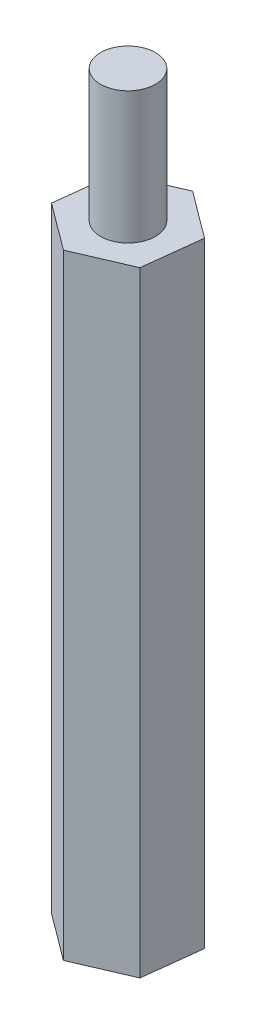
ISO-10303-21;
HEADER;
FILE_DESCRIPTION(('STEP AP214'),'2;1');
FILE_NAME('part.step','',(''),(''),'','','');
FILE_SCHEMA(('AUTOMOTIVE_DESIGN { 1 0 10303 214 1 1 1 1 }'));
ENDSEC;
DATA;
#1=APPLICATION_CONTEXT('core data for automotive mechanical design processes');
#2=APPLICATION_PROTOCOL_DEFINITION('international standard','automotive_design',2000,#1);
#3=PRODUCT_CONTEXT('',#1,'mechanical');
#4=PRODUCT('Part','Part','',(#3));
#5=PRODUCT_RELATED_PRODUCT_CATEGORY('part','',(#4));
#6=PRODUCT_DEFINITION_FORMATION('','',#4);
#7=PRODUCT_DEFINITION_CONTEXT('part definition',#1,'design');
#8=PRODUCT_DEFINITION('design','',#6,#7);
#9=PRODUCT_DEFINITION_SHAPE('','',#8);
#10=(LENGTH_UNIT() NAMED_UNIT(*) SI_UNIT(.MILLI.,.METRE.));
#11=(NAMED_UNIT(*) PLANE_ANGLE_UNIT() SI_UNIT($,.RADIAN.));
#12=(NAMED_UNIT(*) SI_UNIT($,.STERADIAN.) SOLID_ANGLE_UNIT());
#13=UNCERTAINTY_MEASURE_WITH_UNIT(LENGTH_MEASURE(1.E-05),#10,'distance_accuracy_value','');
#14=(GEOMETRIC_REPRESENTATION_CONTEXT(3) GLOBAL_UNCERTAINTY_ASSIGNED_CONTEXT((#13)) GLOBAL_UNIT_ASSIGNED_CONTEXT((#10,
#11,#12)) REPRESENTATION_CONTEXT('',''));
#15=CARTESIAN_POINT('',(0.,0.,0.));
#16=DIRECTION('',(0.,0.,1.));
#17=DIRECTION('',(1.,0.,0.));
#18=AXIS2_PLACEMENT_3D('',#15,#16,#17);
#19=CARTESIAN_POINT('',(-0.30848263547383,28.,2.63198375063584));
#20=DIRECTION('',(-0.395787953347626,0.,-0.918341927598265));
#21=DIRECTION('',(-0.918341927598265,0.,0.395787953347627));
#22=AXIS2_PLACEMENT_3D('',#19,#20,#21);
#23=PLANE('',#22);
#24=DIRECTION('',(0.918341927598265,0.,-0.395787953347626));
#25=VECTOR('',#24,1.);
#26=CARTESIAN_POINT('',(-0.30848263547383,0.,2.63198375063584));
#27=LINE('',#26,#25);
#28=CARTESIAN_POINT('',(-0.30848263547383,0.,2.63198375063584));
#29=VERTEX_POINT('',#28);
#30=CARTESIAN_POINT('',(2.12512347266157,0.,1.58314567426463));
#31=VERTEX_POINT('',#30);
#32=EDGE_CURVE('E124',#29,#31,#27,.T.);
#33=ORIENTED_EDGE('',*,*,#32,.T.);
#34=DIRECTION('',(0.,-1.,0.));
#35=VECTOR('',#34,1.);
#36=CARTESIAN_POINT('',(2.12512347266157,28.,1.58314567426463));
#37=LINE('',#36,#35);
#38=CARTESIAN_POINT('',(2.12512347266157,28.,1.58314567426463));
#39=VERTEX_POINT('',#38);
#40=EDGE_CURVE('E41',#39,#31,#37,.T.);
#41=ORIENTED_EDGE('',*,*,#40,.F.);
#42=DIRECTION('',(0.918341927598265,0.,-0.395787953347626));
#43=VECTOR('',#42,1.);
#44=CARTESIAN_POINT('',(-0.30848263547383,28.,2.63198375063584));
#45=LINE('',#44,#43);
#46=CARTESIAN_POINT('',(-0.30848263547383,28.,2.63198375063584));
#47=VERTEX_POINT('',#46);
#48=EDGE_CURVE('E135',#47,#39,#45,.T.);
#49=ORIENTED_EDGE('',*,*,#48,.F.);
#50=DIRECTION('',(0.,-1.,0.));
#51=VECTOR('',#50,1.);
#52=CARTESIAN_POINT('',(-0.30848263547383,28.,2.63198375063584));
#53=LINE('',#52,#51);
#54=EDGE_CURVE('E120',#47,#29,#53,.T.);
#55=ORIENTED_EDGE('',*,*,#54,.T.);
#56=EDGE_LOOP('',(#33,#41,#49,#55));
#57=FACE_BOUND('',#56,.T.);
#58=ADVANCED_FACE('F38',(#57),#23,.F.);
#59=CARTESIAN_POINT('',(2.12512347266157,28.,1.58314567426463));
#60=DIRECTION('',(-0.993201415334281,0.,-0.116408541688238));
#61=DIRECTION('',(-0.116408541688238,0.,0.993201415334281));
#62=AXIS2_PLACEMENT_3D('',#59,#60,#61);
#63=PLANE('',#62);
#64=DIRECTION('',(0.116408541688238,0.,-0.99320141533428));
#65=VECTOR('',#64,1.);
#66=CARTESIAN_POINT('',(2.12512347266157,0.,1.58314567426463));
#67=LINE('',#66,#65);
#68=CARTESIAN_POINT('',(2.4336061081354,0.,-1.04883807637121));
#69=VERTEX_POINT('',#68);
#70=EDGE_CURVE('E127',#31,#69,#67,.T.);
#71=ORIENTED_EDGE('',*,*,#70,.T.);
#72=DIRECTION('',(0.,-1.,0.));
#73=VECTOR('',#72,1.);
#74=CARTESIAN_POINT('',(2.4336061081354,28.,-1.04883807637121));
#75=LINE('',#74,#73);
#76=CARTESIAN_POINT('',(2.4336061081354,28.,-1.04883807637121));
#77=VERTEX_POINT('',#76);
#78=EDGE_CURVE('E138',#77,#69,#75,.T.);
#79=ORIENTED_EDGE('',*,*,#78,.F.);
#80=DIRECTION('',(0.116408541688238,0.,-0.99320141533428));
#81=VECTOR('',#80,1.);
#82=CARTESIAN_POINT('',(2.12512347266157,28.,1.58314567426463));
#83=LINE('',#82,#81);
#84=EDGE_CURVE('E93',#39,#77,#83,.T.);
#85=ORIENTED_EDGE('',*,*,#84,.F.);
#86=ORIENTED_EDGE('',*,*,#40,.T.);
#87=EDGE_LOOP('',(#71,#79,#85,#86));
#88=FACE_BOUND('',#87,.T.);
#89=ADVANCED_FACE('F143',(#88),#63,.F.);
#90=CARTESIAN_POINT('',(2.4336061081354,28.,-1.04883807637121));
#91=DIRECTION('',(-0.597413461986654,0.,0.801933385910027));
#92=DIRECTION('',(0.801933385910027,0.,0.597413461986654));
#93=AXIS2_PLACEMENT_3D('',#90,#91,#92);
#94=PLANE('',#93);
#95=DIRECTION('',(-0.801933385910027,0.,-0.597413461986654));
#96=VECTOR('',#95,1.);
#97=CARTESIAN_POINT('',(2.4336061081354,0.,-1.04883807637121));
#98=LINE('',#97,#96);
#99=CARTESIAN_POINT('',(0.308482635473831,0.,-2.63198375063584));
#100=VERTEX_POINT('',#99);
#101=EDGE_CURVE('E130',#69,#100,#98,.T.);
#102=ORIENTED_EDGE('',*,*,#101,.T.);
#103=DIRECTION('',(0.,-1.,0.));
#104=VECTOR('',#103,1.);
#105=CARTESIAN_POINT('',(0.308482635473831,28.,-2.63198375063584));
#106=LINE('',#105,#104);
#107=CARTESIAN_POINT('',(0.308482635473831,28.,-2.63198375063584));
#108=VERTEX_POINT('',#107);
#109=EDGE_CURVE('E115',#108,#100,#106,.T.);
#110=ORIENTED_EDGE('',*,*,#109,.F.);
#111=DIRECTION('',(-0.801933385910027,0.,-0.597413461986654));
#112=VECTOR('',#111,1.);
#113=CARTESIAN_POINT('',(2.4336061081354,28.,-1.04883807637121));
#114=LINE('',#113,#112);
#115=EDGE_CURVE('E106',#77,#108,#114,.T.);
#116=ORIENTED_EDGE('',*,*,#115,.F.);
#117=ORIENTED_EDGE('',*,*,#78,.T.);
#118=EDGE_LOOP('',(#102,#110,#116,#117));
#119=FACE_BOUND('',#118,.T.);
#120=ADVANCED_FACE('F149',(#119),#94,.F.);
#121=CARTESIAN_POINT('',(0.308482635473831,28.,-2.63198375063584));
#122=DIRECTION('',(0.395787953347626,0.,0.918341927598265));
#123=DIRECTION('',(0.918341927598265,0.,-0.395787953347626));
#124=AXIS2_PLACEMENT_3D('',#121,#122,#123);
#125=PLANE('',#124);
#126=DIRECTION('',(-0.918341927598265,0.,0.395787953347626));
#127=VECTOR('',#126,1.);
#128=CARTESIAN_POINT('',(0.308482635473831,0.,-2.63198375063584));
#129=LINE('',#128,#127);
#130=CARTESIAN_POINT('',(-2.12512347266157,0.,-1.58314567426463));
#131=VERTEX_POINT('',#130);
#132=EDGE_CURVE('E114',#100,#131,#129,.T.);
#133=ORIENTED_EDGE('',*,*,#132,.T.);
#134=DIRECTION('',(0.,-1.,0.));
#135=VECTOR('',#134,1.);
#136=CARTESIAN_POINT('',(-2.12512347266157,28.,-1.58314567426463));
#137=LINE('',#136,#135);
#138=CARTESIAN_POINT('',(-2.12512347266157,28.,-1.58314567426463));
#139=VERTEX_POINT('',#138);
#140=EDGE_CURVE('E111',#139,#131,#137,.T.);
#141=ORIENTED_EDGE('',*,*,#140,.F.);
#142=DIRECTION('',(-0.918341927598265,0.,0.395787953347626));
#143=VECTOR('',#142,1.);
#144=CARTESIAN_POINT('',(0.308482635473831,28.,-2.63198375063584));
#145=LINE('',#144,#143);
#146=EDGE_CURVE('E100',#108,#139,#145,.T.);
#147=ORIENTED_EDGE('',*,*,#146,.F.);
#148=ORIENTED_EDGE('',*,*,#109,.T.);
#149=EDGE_LOOP('',(#133,#141,#147,#148));
#150=FACE_BOUND('',#149,.T.);
#151=ADVANCED_FACE('F112',(#150),#125,.F.);
#152=CARTESIAN_POINT('',(-2.12512347266157,28.,-1.58314567426463));
#153=DIRECTION('',(0.993201415334281,0.,0.116408541688238));
#154=DIRECTION('',(0.116408541688238,0.,-0.993201415334281));
#155=AXIS2_PLACEMENT_3D('',#152,#153,#154);
#156=PLANE('',#155);
#157=DIRECTION('',(-0.116408541688238,0.,0.99320141533428));
#158=VECTOR('',#157,1.);
#159=CARTESIAN_POINT('',(-2.12512347266157,0.,-1.58314567426463));
#160=LINE('',#159,#158);
#161=CARTESIAN_POINT('',(-2.4336061081354,0.,1.04883807637121));
#162=VERTEX_POINT('',#161);
#163=EDGE_CURVE('E78',#131,#162,#160,.T.);
#164=ORIENTED_EDGE('',*,*,#163,.T.);
#165=DIRECTION('',(0.,-1.,0.));
#166=VECTOR('',#165,1.);
#167=CARTESIAN_POINT('',(-2.4336061081354,28.,1.04883807637121));
#168=LINE('',#167,#166);
#169=CARTESIAN_POINT('',(-2.4336061081354,28.,1.04883807637121));
#170=VERTEX_POINT('',#169);
#171=EDGE_CURVE('E116',#170,#162,#168,.T.);
#172=ORIENTED_EDGE('',*,*,#171,.F.);
#173=DIRECTION('',(-0.116408541688238,0.,0.99320141533428));
#174=VECTOR('',#173,1.);
#175=CARTESIAN_POINT('',(-2.12512347266157,28.,-1.58314567426463));
#176=LINE('',#175,#174);
#177=EDGE_CURVE('E104',#139,#170,#176,.T.);
#178=ORIENTED_EDGE('',*,*,#177,.F.);
#179=ORIENTED_EDGE('',*,*,#140,.T.);
#180=EDGE_LOOP('',(#164,#172,#178,#179));
#181=FACE_BOUND('',#180,.T.);
#182=ADVANCED_FACE('F118',(#181),#156,.F.);
#183=CARTESIAN_POINT('',(-2.4336061081354,28.,1.04883807637121));
#184=DIRECTION('',(0.597413461986654,0.,-0.801933385910027));
#185=DIRECTION('',(-0.801933385910027,0.,-0.597413461986654));
#186=AXIS2_PLACEMENT_3D('',#183,#184,#185);
#187=PLANE('',#186);
#188=DIRECTION('',(0.801933385910027,0.,0.597413461986654));
#189=VECTOR('',#188,1.);
#190=CARTESIAN_POINT('',(-2.4336061081354,0.,1.04883807637121));
#191=LINE('',#190,#189);
#192=EDGE_CURVE('E84',#162,#29,#191,.T.);
#193=ORIENTED_EDGE('',*,*,#192,.T.);
#194=ORIENTED_EDGE('',*,*,#54,.F.);
#195=DIRECTION('',(0.801933385910027,0.,0.597413461986654));
#196=VECTOR('',#195,1.);
#197=CARTESIAN_POINT('',(-2.4336061081354,28.,1.04883807637121));
#198=LINE('',#197,#196);
#199=EDGE_CURVE('E55',#170,#47,#198,.T.);
#200=ORIENTED_EDGE('',*,*,#199,.F.);
#201=ORIENTED_EDGE('',*,*,#171,.T.);
#202=EDGE_LOOP('',(#193,#194,#200,#201));
#203=FACE_BOUND('',#202,.T.);
#204=ADVANCED_FACE('F180',(#203),#187,.F.);
#205=CARTESIAN_POINT('',(0.,28.,0.));
#206=DIRECTION('',(0.,1.,0.));
#207=DIRECTION('',(0.,0.,1.));
#208=AXIS2_PLACEMENT_3D('',#205,#206,#207);
#209=PLANE('',#208);
#210=CARTESIAN_POINT('',(0.,28.,0.));
#211=DIRECTION('',(0.,1.,0.));
#212=DIRECTION('',(0.,0.,1.));
#213=AXIS2_PLACEMENT_3D('',#210,#211,#212);
#214=CIRCLE('',#213,1.25);
#215=CARTESIAN_POINT('',(0.,28.,1.25));
#216=VERTEX_POINT('',#215);
#217=EDGE_CURVE('E11',#216,#216,#214,.T.);
#218=ORIENTED_EDGE('',*,*,#217,.F.);
#219=EDGE_LOOP('',(#218));
#220=FACE_BOUND('',#219,.T.);
#221=ORIENTED_EDGE('',*,*,#48,.T.);
#222=ORIENTED_EDGE('',*,*,#84,.T.);
#223=ORIENTED_EDGE('',*,*,#115,.T.);
#224=ORIENTED_EDGE('',*,*,#146,.T.);
#225=ORIENTED_EDGE('',*,*,#177,.T.);
#226=ORIENTED_EDGE('',*,*,#199,.T.);
#227=EDGE_LOOP('',(#221,#222,#223,#224,#225,#226));
#228=FACE_BOUND('',#227,.T.);
#229=ADVANCED_FACE('F102',(#220,#228),#209,.T.);
#230=CARTESIAN_POINT('',(0.,0.,0.));
#231=DIRECTION('',(0.,1.,0.));
#232=DIRECTION('',(0.,0.,1.));
#233=AXIS2_PLACEMENT_3D('',#230,#231,#232);
#234=PLANE('',#233);
#235=CARTESIAN_POINT('',(0.,0.,0.));
#236=DIRECTION('',(0.,-1.,0.));
#237=DIRECTION('',(0.,0.,-1.));
#238=AXIS2_PLACEMENT_3D('',#235,#236,#237);
#239=CIRCLE('',#238,1.25);
#240=CARTESIAN_POINT('',(0.,0.,-1.25));
#241=VERTEX_POINT('',#240);
#242=EDGE_CURVE('E156',#241,#241,#239,.T.);
#243=ORIENTED_EDGE('',*,*,#242,.F.);
#244=EDGE_LOOP('',(#243));
#245=FACE_BOUND('',#244,.T.);
#246=ORIENTED_EDGE('',*,*,#32,.F.);
#247=ORIENTED_EDGE('',*,*,#192,.F.);
#248=ORIENTED_EDGE('',*,*,#163,.F.);
#249=ORIENTED_EDGE('',*,*,#132,.F.);
#250=ORIENTED_EDGE('',*,*,#101,.F.);
#251=ORIENTED_EDGE('',*,*,#70,.F.);
#252=EDGE_LOOP('',(#246,#247,#248,#249,#250,#251));
#253=FACE_BOUND('',#252,.T.);
#254=ADVANCED_FACE('F148',(#245,#253),#234,.F.);
#255=CARTESIAN_POINT('',(0.,34.,0.));
#256=DIRECTION('',(0.,-1.,0.));
#257=DIRECTION('',(0.,0.,-1.));
#258=AXIS2_PLACEMENT_3D('',#255,#256,#257);
#259=CYLINDRICAL_SURFACE('',#258,1.25);
#260=CARTESIAN_POINT('',(0.,34.,0.));
#261=DIRECTION('',(0.,1.,0.));
#262=DIRECTION('',(0.,0.,1.));
#263=AXIS2_PLACEMENT_3D('',#260,#261,#262);
#264=CIRCLE('',#263,1.25);
#265=CARTESIAN_POINT('',(0.,34.,1.25));
#266=VERTEX_POINT('',#265);
#267=EDGE_CURVE('E128',#266,#266,#264,.T.);
#268=ORIENTED_EDGE('',*,*,#267,.F.);
#269=EDGE_LOOP('',(#268));
#270=FACE_BOUND('',#269,.T.);
#271=ORIENTED_EDGE('',*,*,#217,.T.);
#272=EDGE_LOOP('',(#271));
#273=FACE_BOUND('',#272,.T.);
#274=ADVANCED_FACE('F172',(#270,#273),#259,.T.);
#275=CARTESIAN_POINT('',(0.,34.,0.));
#276=DIRECTION('',(0.,1.,0.));
#277=DIRECTION('',(0.,0.,1.));
#278=AXIS2_PLACEMENT_3D('',#275,#276,#277);
#279=PLANE('',#278);
#280=ORIENTED_EDGE('',*,*,#267,.T.);
#281=EDGE_LOOP('',(#280));
#282=FACE_BOUND('',#281,.T.);
#283=ADVANCED_FACE('F167',(#282),#279,.T.);
#284=CARTESIAN_POINT('',(0.,6.,0.));
#285=DIRECTION('',(0.,-1.,0.));
#286=DIRECTION('',(0.,0.,-1.));
#287=AXIS2_PLACEMENT_3D('',#284,#285,#286);
#288=CYLINDRICAL_SURFACE('',#287,1.25);
#289=CARTESIAN_POINT('',(0.,6.,0.));
#290=DIRECTION('',(0.,-1.,0.));
#291=DIRECTION('',(0.,0.,-1.));
#292=AXIS2_PLACEMENT_3D('',#289,#290,#291);
#293=CIRCLE('',#292,1.25);
#294=CARTESIAN_POINT('',(0.,6.,-1.25));
#295=VERTEX_POINT('',#294);
#296=EDGE_CURVE('E155',#295,#295,#293,.T.);
#297=ORIENTED_EDGE('',*,*,#296,.F.);
#298=EDGE_LOOP('',(#297));
#299=FACE_BOUND('',#298,.T.);
#300=ORIENTED_EDGE('',*,*,#242,.T.);
#301=EDGE_LOOP('',(#300));
#302=FACE_BOUND('',#301,.T.);
#303=ADVANCED_FACE('F164',(#299,#302),#288,.F.);
#304=CARTESIAN_POINT('',(0.,6.,0.));
#305=DIRECTION('',(0.,-1.,0.));
#306=DIRECTION('',(0.,0.,-1.));
#307=AXIS2_PLACEMENT_3D('',#304,#305,#306);
#308=PLANE('',#307);
#309=ORIENTED_EDGE('',*,*,#296,.T.);
#310=EDGE_LOOP('',(#309));
#311=FACE_BOUND('',#310,.T.);
#312=ADVANCED_FACE('F162',(#311),#308,.T.);
#313=CLOSED_SHELL('',(#58,#89,#120,#151,#182,#204,#229,#254,#274,#283,#303,#312));
#314=MANIFOLD_SOLID_BREP('B2',#313);
#315=ADVANCED_BREP_SHAPE_REPRESENTATION('',(#18,#314),#14);
#316=SHAPE_DEFINITION_REPRESENTATION(#9,#315);
ENDSEC;
END-ISO-10303-21;
